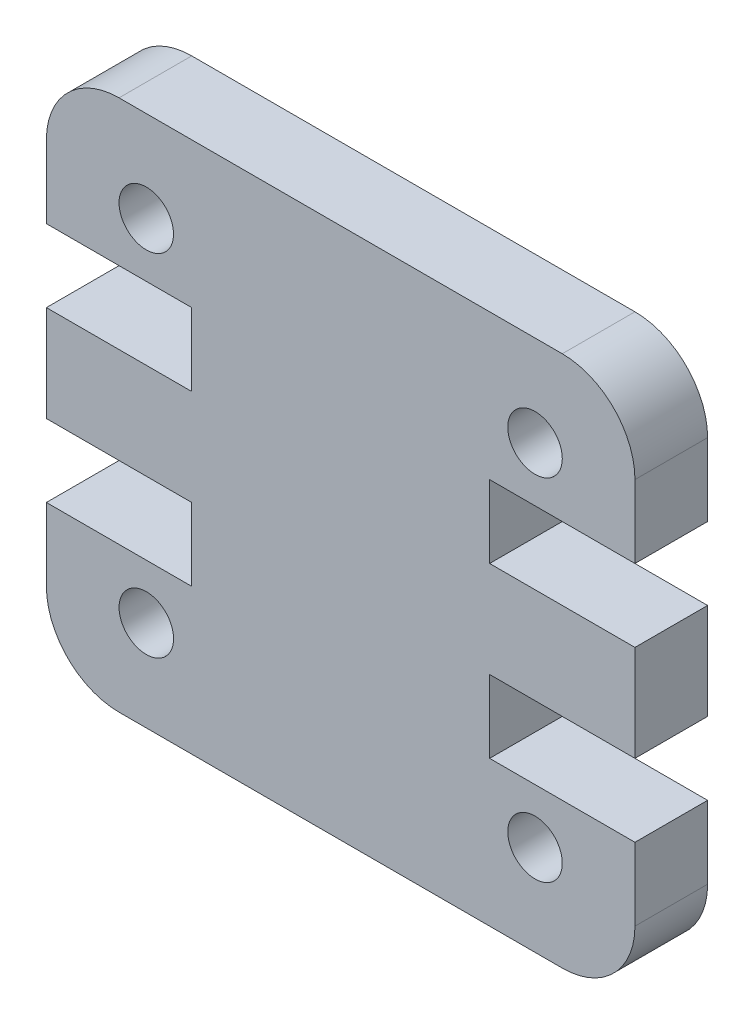
ISO-10303-21;
HEADER;
FILE_DESCRIPTION(('STEP AP214'),'2;1');
FILE_NAME('part.step','',(''),(''),'','','');
FILE_SCHEMA(('AUTOMOTIVE_DESIGN { 1 0 10303 214 1 1 1 1 }'));
ENDSEC;
DATA;
#1=APPLICATION_CONTEXT('core data for automotive mechanical design processes');
#2=APPLICATION_PROTOCOL_DEFINITION('international standard','automotive_design',2000,#1);
#3=PRODUCT_CONTEXT('',#1,'mechanical');
#4=PRODUCT('Part','Part','',(#3));
#5=PRODUCT_RELATED_PRODUCT_CATEGORY('part','',(#4));
#6=PRODUCT_DEFINITION_FORMATION('','',#4);
#7=PRODUCT_DEFINITION_CONTEXT('part definition',#1,'design');
#8=PRODUCT_DEFINITION('design','',#6,#7);
#9=PRODUCT_DEFINITION_SHAPE('','',#8);
#10=(LENGTH_UNIT() NAMED_UNIT(*) SI_UNIT(.MILLI.,.METRE.));
#11=(NAMED_UNIT(*) PLANE_ANGLE_UNIT() SI_UNIT($,.RADIAN.));
#12=(NAMED_UNIT(*) SI_UNIT($,.STERADIAN.) SOLID_ANGLE_UNIT());
#13=UNCERTAINTY_MEASURE_WITH_UNIT(LENGTH_MEASURE(1.E-05),#10,'distance_accuracy_value','');
#14=(GEOMETRIC_REPRESENTATION_CONTEXT(3) GLOBAL_UNCERTAINTY_ASSIGNED_CONTEXT((#13)) GLOBAL_UNIT_ASSIGNED_CONTEXT((#10,
#11,#12)) REPRESENTATION_CONTEXT('',''));
#15=CARTESIAN_POINT('',(0.,0.,0.));
#16=DIRECTION('',(0.,0.,1.));
#17=DIRECTION('',(1.,0.,0.));
#18=AXIS2_PLACEMENT_3D('',#15,#16,#17);
#19=CARTESIAN_POINT('',(14.2,2.,2.));
#20=DIRECTION('',(0.,0.,-1.));
#21=DIRECTION('',(-1.,0.,0.));
#22=AXIS2_PLACEMENT_3D('',#19,#20,#21);
#23=PLANE('',#22);
#24=CARTESIAN_POINT('',(13.4499999999986,12.1450000000001,2.));
#25=DIRECTION('',(0.,0.,1.));
#26=DIRECTION('',(1.,0.,0.));
#27=AXIS2_PLACEMENT_3D('',#24,#25,#26);
#28=CIRCLE('',#27,0.750000000000002);
#29=CARTESIAN_POINT('',(14.1999999999986,12.1450000000001,2.));
#30=VERTEX_POINT('',#29);
#31=EDGE_CURVE('E448',#30,#30,#28,.T.);
#32=ORIENTED_EDGE('',*,*,#31,.F.);
#33=EDGE_LOOP('',(#32));
#34=FACE_BOUND('',#33,.T.);
#35=CARTESIAN_POINT('',(13.4499999999986,2.4999999999999,2.));
#36=DIRECTION('',(0.,0.,1.));
#37=DIRECTION('',(-1.,0.,0.));
#38=AXIS2_PLACEMENT_3D('',#35,#36,#37);
#39=CIRCLE('',#38,0.750000000000002);
#40=CARTESIAN_POINT('',(12.6999999999986,2.4999999999999,2.));
#41=VERTEX_POINT('',#40);
#42=EDGE_CURVE('E230',#41,#41,#39,.T.);
#43=ORIENTED_EDGE('',*,*,#42,.F.);
#44=EDGE_LOOP('',(#43));
#45=FACE_BOUND('',#44,.T.);
#46=CARTESIAN_POINT('',(14.2,2.,2.));
#47=DIRECTION('',(0.,0.,1.));
#48=DIRECTION('',(-1.,0.,0.));
#49=AXIS2_PLACEMENT_3D('',#46,#47,#48);
#50=CIRCLE('',#49,2.);
#51=CARTESIAN_POINT('',(14.2,0.,2.));
#52=VERTEX_POINT('',#51);
#53=CARTESIAN_POINT('',(16.2,2.,2.));
#54=VERTEX_POINT('',#53);
#55=EDGE_CURVE('E273',#52,#54,#50,.T.);
#56=ORIENTED_EDGE('',*,*,#55,.T.);
#57=DIRECTION('',(0.,1.,0.));
#58=VECTOR('',#57,1.);
#59=CARTESIAN_POINT('',(16.2,4.,2.));
#60=LINE('',#59,#58);
#61=CARTESIAN_POINT('',(16.2,4.,2.));
#62=VERTEX_POINT('',#61);
#63=EDGE_CURVE('E141',#54,#62,#60,.T.);
#64=ORIENTED_EDGE('',*,*,#63,.T.);
#65=DIRECTION('',(-1.,0.,0.));
#66=VECTOR('',#65,1.);
#67=CARTESIAN_POINT('',(12.2,4.,2.));
#68=LINE('',#67,#66);
#69=CARTESIAN_POINT('',(12.2,4.,2.));
#70=VERTEX_POINT('',#69);
#71=EDGE_CURVE('E336',#62,#70,#68,.T.);
#72=ORIENTED_EDGE('',*,*,#71,.T.);
#73=DIRECTION('',(0.,1.,0.));
#74=VECTOR('',#73,1.);
#75=CARTESIAN_POINT('',(12.2,6.,2.));
#76=LINE('',#75,#74);
#77=CARTESIAN_POINT('',(12.2,6.,2.));
#78=VERTEX_POINT('',#77);
#79=EDGE_CURVE('E355',#70,#78,#76,.T.);
#80=ORIENTED_EDGE('',*,*,#79,.T.);
#81=DIRECTION('',(1.,0.,0.));
#82=VECTOR('',#81,1.);
#83=CARTESIAN_POINT('',(16.2,6.,2.));
#84=LINE('',#83,#82);
#85=CARTESIAN_POINT('',(16.2,6.,2.));
#86=VERTEX_POINT('',#85);
#87=EDGE_CURVE('E352',#78,#86,#84,.T.);
#88=ORIENTED_EDGE('',*,*,#87,.T.);
#89=DIRECTION('',(0.,1.,0.));
#90=VECTOR('',#89,1.);
#91=CARTESIAN_POINT('',(16.2,8.64499999999999,2.));
#92=LINE('',#91,#90);
#93=CARTESIAN_POINT('',(16.2,8.64499999999999,2.));
#94=VERTEX_POINT('',#93);
#95=EDGE_CURVE('E354',#86,#94,#92,.T.);
#96=ORIENTED_EDGE('',*,*,#95,.T.);
#97=DIRECTION('',(-1.,0.,0.));
#98=VECTOR('',#97,1.);
#99=CARTESIAN_POINT('',(16.2,8.64499999999999,2.));
#100=LINE('',#99,#98);
#101=CARTESIAN_POINT('',(12.2,8.64499999999999,2.));
#102=VERTEX_POINT('',#101);
#103=EDGE_CURVE('E357',#94,#102,#100,.T.);
#104=ORIENTED_EDGE('',*,*,#103,.T.);
#105=DIRECTION('',(0.,1.,0.));
#106=VECTOR('',#105,1.);
#107=CARTESIAN_POINT('',(12.2,8.64499999999999,2.));
#108=LINE('',#107,#106);
#109=CARTESIAN_POINT('',(12.2,10.645,2.));
#110=VERTEX_POINT('',#109);
#111=EDGE_CURVE('E363',#102,#110,#108,.T.);
#112=ORIENTED_EDGE('',*,*,#111,.T.);
#113=DIRECTION('',(1.,0.,0.));
#114=VECTOR('',#113,1.);
#115=CARTESIAN_POINT('',(12.2,10.645,2.));
#116=LINE('',#115,#114);
#117=CARTESIAN_POINT('',(16.2,10.645,2.));
#118=VERTEX_POINT('',#117);
#119=EDGE_CURVE('E365',#110,#118,#116,.T.);
#120=ORIENTED_EDGE('',*,*,#119,.T.);
#121=DIRECTION('',(0.,1.,0.));
#122=VECTOR('',#121,1.);
#123=CARTESIAN_POINT('',(16.2,10.645,2.));
#124=LINE('',#123,#122);
#125=CARTESIAN_POINT('',(16.2,12.645,2.));
#126=VERTEX_POINT('',#125);
#127=EDGE_CURVE('E367',#118,#126,#124,.T.);
#128=ORIENTED_EDGE('',*,*,#127,.T.);
#129=CARTESIAN_POINT('',(14.2,12.645,2.));
#130=DIRECTION('',(0.,0.,1.));
#131=DIRECTION('',(1.,0.,0.));
#132=AXIS2_PLACEMENT_3D('',#129,#130,#131);
#133=CIRCLE('',#132,2.);
#134=CARTESIAN_POINT('',(14.2,14.645,2.));
#135=VERTEX_POINT('',#134);
#136=EDGE_CURVE('E369',#126,#135,#133,.T.);
#137=ORIENTED_EDGE('',*,*,#136,.T.);
#138=DIRECTION('',(-1.,0.,0.));
#139=VECTOR('',#138,1.);
#140=CARTESIAN_POINT('',(2.,14.645,2.));
#141=LINE('',#140,#139);
#142=CARTESIAN_POINT('',(2.,14.645,2.));
#143=VERTEX_POINT('',#142);
#144=EDGE_CURVE('E371',#135,#143,#141,.T.);
#145=ORIENTED_EDGE('',*,*,#144,.T.);
#146=CARTESIAN_POINT('',(2.,12.645,2.));
#147=DIRECTION('',(0.,0.,1.));
#148=DIRECTION('',(-1.,0.,0.));
#149=AXIS2_PLACEMENT_3D('',#146,#147,#148);
#150=CIRCLE('',#149,2.);
#151=CARTESIAN_POINT('',(0.,12.645,2.));
#152=VERTEX_POINT('',#151);
#153=EDGE_CURVE('E373',#143,#152,#150,.T.);
#154=ORIENTED_EDGE('',*,*,#153,.T.);
#155=DIRECTION('',(0.,-1.,0.));
#156=VECTOR('',#155,1.);
#157=CARTESIAN_POINT('',(0.,10.645,2.));
#158=LINE('',#157,#156);
#159=CARTESIAN_POINT('',(0.,10.645,2.));
#160=VERTEX_POINT('',#159);
#161=EDGE_CURVE('E375',#152,#160,#158,.T.);
#162=ORIENTED_EDGE('',*,*,#161,.T.);
#163=DIRECTION('',(1.,0.,0.));
#164=VECTOR('',#163,1.);
#165=CARTESIAN_POINT('',(4.,10.645,2.));
#166=LINE('',#165,#164);
#167=CARTESIAN_POINT('',(4.,10.645,2.));
#168=VERTEX_POINT('',#167);
#169=EDGE_CURVE('E377',#160,#168,#166,.T.);
#170=ORIENTED_EDGE('',*,*,#169,.T.);
#171=DIRECTION('',(0.,-1.,0.));
#172=VECTOR('',#171,1.);
#173=CARTESIAN_POINT('',(4.,8.64499999999999,2.));
#174=LINE('',#173,#172);
#175=CARTESIAN_POINT('',(4.,8.64499999999999,2.));
#176=VERTEX_POINT('',#175);
#177=EDGE_CURVE('E379',#168,#176,#174,.T.);
#178=ORIENTED_EDGE('',*,*,#177,.T.);
#179=DIRECTION('',(-1.,0.,0.));
#180=VECTOR('',#179,1.);
#181=CARTESIAN_POINT('',(0.,8.64499999999999,2.));
#182=LINE('',#181,#180);
#183=CARTESIAN_POINT('',(0.,8.64499999999999,2.));
#184=VERTEX_POINT('',#183);
#185=EDGE_CURVE('E381',#176,#184,#182,.T.);
#186=ORIENTED_EDGE('',*,*,#185,.T.);
#187=DIRECTION('',(0.,-1.,0.));
#188=VECTOR('',#187,1.);
#189=CARTESIAN_POINT('',(0.,8.64499999999999,2.));
#190=LINE('',#189,#188);
#191=CARTESIAN_POINT('',(0.,6.00000000000003,2.));
#192=VERTEX_POINT('',#191);
#193=EDGE_CURVE('E383',#184,#192,#190,.T.);
#194=ORIENTED_EDGE('',*,*,#193,.T.);
#195=DIRECTION('',(1.,0.,0.));
#196=VECTOR('',#195,1.);
#197=CARTESIAN_POINT('',(0.,6.00000000000003,2.));
#198=LINE('',#197,#196);
#199=CARTESIAN_POINT('',(4.00000000000003,6.00000000000003,2.));
#200=VERTEX_POINT('',#199);
#201=EDGE_CURVE('E385',#192,#200,#198,.T.);
#202=ORIENTED_EDGE('',*,*,#201,.T.);
#203=DIRECTION('',(0.,-1.,0.));
#204=VECTOR('',#203,1.);
#205=CARTESIAN_POINT('',(4.00000000000003,6.00000000000003,2.));
#206=LINE('',#205,#204);
#207=CARTESIAN_POINT('',(4.00000000000003,4.00000000000002,2.));
#208=VERTEX_POINT('',#207);
#209=EDGE_CURVE('E387',#200,#208,#206,.T.);
#210=ORIENTED_EDGE('',*,*,#209,.T.);
#211=DIRECTION('',(-1.,0.,0.));
#212=VECTOR('',#211,1.);
#213=CARTESIAN_POINT('',(4.00000000000003,4.00000000000002,2.));
#214=LINE('',#213,#212);
#215=CARTESIAN_POINT('',(0.,4.00000000000003,2.));
#216=VERTEX_POINT('',#215);
#217=EDGE_CURVE('E208',#208,#216,#214,.T.);
#218=ORIENTED_EDGE('',*,*,#217,.T.);
#219=DIRECTION('',(0.,-1.,0.));
#220=VECTOR('',#219,1.);
#221=CARTESIAN_POINT('',(0.,4.00000000000003,2.));
#222=LINE('',#221,#220);
#223=CARTESIAN_POINT('',(0.,2.00000000000003,2.));
#224=VERTEX_POINT('',#223);
#225=EDGE_CURVE('E202',#216,#224,#222,.T.);
#226=ORIENTED_EDGE('',*,*,#225,.T.);
#227=CARTESIAN_POINT('',(2.,2.,2.));
#228=DIRECTION('',(0.,0.,1.));
#229=DIRECTION('',(1.,0.,0.));
#230=AXIS2_PLACEMENT_3D('',#227,#228,#229);
#231=CIRCLE('',#230,2.);
#232=CARTESIAN_POINT('',(2.,0.,2.));
#233=VERTEX_POINT('',#232);
#234=EDGE_CURVE('E206',#224,#233,#231,.T.);
#235=ORIENTED_EDGE('',*,*,#234,.T.);
#236=DIRECTION('',(1.,0.,0.));
#237=VECTOR('',#236,1.);
#238=CARTESIAN_POINT('',(2.,0.,2.));
#239=LINE('',#238,#237);
#240=EDGE_CURVE('E50',#233,#52,#239,.T.);
#241=ORIENTED_EDGE('',*,*,#240,.T.);
#242=EDGE_LOOP('',(#56,#64,#72,#80,#88,#96,#104,#112,#120,#128,#137,#145,#154,#162,#170,#178,
#186,#194,#202,#210,#218,#226,#235,#241));
#243=FACE_BOUND('',#242,.T.);
#244=CARTESIAN_POINT('',(2.75000000000139,12.1450000000001,2.));
#245=DIRECTION('',(0.,0.,1.));
#246=DIRECTION('',(-1.,0.,0.));
#247=AXIS2_PLACEMENT_3D('',#244,#245,#246);
#248=CIRCLE('',#247,0.750000000000001);
#249=CARTESIAN_POINT('',(2.00000000000139,12.1450000000001,2.));
#250=VERTEX_POINT('',#249);
#251=EDGE_CURVE('E454',#250,#250,#248,.T.);
#252=ORIENTED_EDGE('',*,*,#251,.F.);
#253=EDGE_LOOP('',(#252));
#254=FACE_BOUND('',#253,.T.);
#255=CARTESIAN_POINT('',(2.75000000000139,2.4999999999999,2.));
#256=DIRECTION('',(0.,0.,1.));
#257=DIRECTION('',(1.,0.,0.));
#258=AXIS2_PLACEMENT_3D('',#255,#256,#257);
#259=CIRCLE('',#258,0.75);
#260=CARTESIAN_POINT('',(3.50000000000139,2.4999999999999,2.));
#261=VERTEX_POINT('',#260);
#262=EDGE_CURVE('E439',#261,#261,#259,.T.);
#263=ORIENTED_EDGE('',*,*,#262,.F.);
#264=EDGE_LOOP('',(#263));
#265=FACE_BOUND('',#264,.T.);
#266=ADVANCED_FACE('F33',(#34,#45,#243,#254,#265),#23,.F.);
#267=CARTESIAN_POINT('',(14.2,2.,0.));
#268=DIRECTION('',(0.,0.,-1.));
#269=DIRECTION('',(-1.,0.,0.));
#270=AXIS2_PLACEMENT_3D('',#267,#268,#269);
#271=PLANE('',#270);
#272=CARTESIAN_POINT('',(13.4499999999986,12.1450000000001,0.));
#273=DIRECTION('',(0.,0.,1.));
#274=DIRECTION('',(1.,0.,0.));
#275=AXIS2_PLACEMENT_3D('',#272,#273,#274);
#276=CIRCLE('',#275,0.750000000000002);
#277=CARTESIAN_POINT('',(14.1999999999986,12.1450000000001,0.));
#278=VERTEX_POINT('',#277);
#279=EDGE_CURVE('E445',#278,#278,#276,.T.);
#280=ORIENTED_EDGE('',*,*,#279,.T.);
#281=EDGE_LOOP('',(#280));
#282=FACE_BOUND('',#281,.T.);
#283=CARTESIAN_POINT('',(13.4499999999986,2.4999999999999,0.));
#284=DIRECTION('',(0.,0.,1.));
#285=DIRECTION('',(-1.,0.,0.));
#286=AXIS2_PLACEMENT_3D('',#283,#284,#285);
#287=CIRCLE('',#286,0.750000000000002);
#288=CARTESIAN_POINT('',(12.6999999999986,2.4999999999999,0.));
#289=VERTEX_POINT('',#288);
#290=EDGE_CURVE('E457',#289,#289,#287,.T.);
#291=ORIENTED_EDGE('',*,*,#290,.T.);
#292=EDGE_LOOP('',(#291));
#293=FACE_BOUND('',#292,.T.);
#294=CARTESIAN_POINT('',(14.2,2.,0.));
#295=DIRECTION('',(0.,0.,1.));
#296=DIRECTION('',(-1.,0.,0.));
#297=AXIS2_PLACEMENT_3D('',#294,#295,#296);
#298=CIRCLE('',#297,2.);
#299=CARTESIAN_POINT('',(14.2,0.,0.));
#300=VERTEX_POINT('',#299);
#301=CARTESIAN_POINT('',(16.2,2.,0.));
#302=VERTEX_POINT('',#301);
#303=EDGE_CURVE('E226',#300,#302,#298,.T.);
#304=ORIENTED_EDGE('',*,*,#303,.F.);
#305=DIRECTION('',(1.,0.,0.));
#306=VECTOR('',#305,1.);
#307=CARTESIAN_POINT('',(2.,0.,0.));
#308=LINE('',#307,#306);
#309=CARTESIAN_POINT('',(2.,0.,0.));
#310=VERTEX_POINT('',#309);
#311=EDGE_CURVE('E133',#310,#300,#308,.T.);
#312=ORIENTED_EDGE('',*,*,#311,.F.);
#313=CARTESIAN_POINT('',(2.,2.,0.));
#314=DIRECTION('',(0.,0.,1.));
#315=DIRECTION('',(1.,0.,0.));
#316=AXIS2_PLACEMENT_3D('',#313,#314,#315);
#317=CIRCLE('',#316,2.);
#318=CARTESIAN_POINT('',(0.,2.00000000000003,0.));
#319=VERTEX_POINT('',#318);
#320=EDGE_CURVE('E127',#319,#310,#317,.T.);
#321=ORIENTED_EDGE('',*,*,#320,.F.);
#322=DIRECTION('',(0.,-1.,0.));
#323=VECTOR('',#322,1.);
#324=CARTESIAN_POINT('',(0.,4.00000000000003,0.));
#325=LINE('',#324,#323);
#326=CARTESIAN_POINT('',(0.,4.00000000000003,0.));
#327=VERTEX_POINT('',#326);
#328=EDGE_CURVE('E216',#327,#319,#325,.T.);
#329=ORIENTED_EDGE('',*,*,#328,.F.);
#330=DIRECTION('',(-1.,0.,0.));
#331=VECTOR('',#330,1.);
#332=CARTESIAN_POINT('',(4.00000000000003,4.00000000000002,0.));
#333=LINE('',#332,#331);
#334=CARTESIAN_POINT('',(4.00000000000003,4.00000000000002,0.));
#335=VERTEX_POINT('',#334);
#336=EDGE_CURVE('E268',#335,#327,#333,.T.);
#337=ORIENTED_EDGE('',*,*,#336,.F.);
#338=DIRECTION('',(0.,-1.,0.));
#339=VECTOR('',#338,1.);
#340=CARTESIAN_POINT('',(4.00000000000003,6.00000000000003,0.));
#341=LINE('',#340,#339);
#342=CARTESIAN_POINT('',(4.00000000000003,6.00000000000003,0.));
#343=VERTEX_POINT('',#342);
#344=EDGE_CURVE('E266',#343,#335,#341,.T.);
#345=ORIENTED_EDGE('',*,*,#344,.F.);
#346=DIRECTION('',(1.,0.,0.));
#347=VECTOR('',#346,1.);
#348=CARTESIAN_POINT('',(0.,6.00000000000003,0.));
#349=LINE('',#348,#347);
#350=CARTESIAN_POINT('',(0.,6.00000000000003,0.));
#351=VERTEX_POINT('',#350);
#352=EDGE_CURVE('E264',#351,#343,#349,.T.);
#353=ORIENTED_EDGE('',*,*,#352,.F.);
#354=DIRECTION('',(0.,-1.,0.));
#355=VECTOR('',#354,1.);
#356=CARTESIAN_POINT('',(0.,8.64499999999999,0.));
#357=LINE('',#356,#355);
#358=CARTESIAN_POINT('',(0.,8.64499999999999,0.));
#359=VERTEX_POINT('',#358);
#360=EDGE_CURVE('E262',#359,#351,#357,.T.);
#361=ORIENTED_EDGE('',*,*,#360,.F.);
#362=DIRECTION('',(-1.,0.,0.));
#363=VECTOR('',#362,1.);
#364=CARTESIAN_POINT('',(0.,8.64499999999999,0.));
#365=LINE('',#364,#363);
#366=CARTESIAN_POINT('',(4.,8.64499999999999,0.));
#367=VERTEX_POINT('',#366);
#368=EDGE_CURVE('E260',#367,#359,#365,.T.);
#369=ORIENTED_EDGE('',*,*,#368,.F.);
#370=DIRECTION('',(0.,-1.,0.));
#371=VECTOR('',#370,1.);
#372=CARTESIAN_POINT('',(4.,8.64499999999999,0.));
#373=LINE('',#372,#371);
#374=CARTESIAN_POINT('',(4.,10.645,0.));
#375=VERTEX_POINT('',#374);
#376=EDGE_CURVE('E258',#375,#367,#373,.T.);
#377=ORIENTED_EDGE('',*,*,#376,.F.);
#378=DIRECTION('',(1.,0.,0.));
#379=VECTOR('',#378,1.);
#380=CARTESIAN_POINT('',(4.,10.645,0.));
#381=LINE('',#380,#379);
#382=CARTESIAN_POINT('',(0.,10.645,0.));
#383=VERTEX_POINT('',#382);
#384=EDGE_CURVE('E256',#383,#375,#381,.T.);
#385=ORIENTED_EDGE('',*,*,#384,.F.);
#386=DIRECTION('',(0.,-1.,0.));
#387=VECTOR('',#386,1.);
#388=CARTESIAN_POINT('',(0.,10.645,0.));
#389=LINE('',#388,#387);
#390=CARTESIAN_POINT('',(0.,12.645,0.));
#391=VERTEX_POINT('',#390);
#392=EDGE_CURVE('E254',#391,#383,#389,.T.);
#393=ORIENTED_EDGE('',*,*,#392,.F.);
#394=CARTESIAN_POINT('',(2.,12.645,0.));
#395=DIRECTION('',(0.,0.,1.));
#396=DIRECTION('',(-1.,0.,0.));
#397=AXIS2_PLACEMENT_3D('',#394,#395,#396);
#398=CIRCLE('',#397,2.);
#399=CARTESIAN_POINT('',(2.,14.645,0.));
#400=VERTEX_POINT('',#399);
#401=EDGE_CURVE('E252',#400,#391,#398,.T.);
#402=ORIENTED_EDGE('',*,*,#401,.F.);
#403=DIRECTION('',(-1.,0.,0.));
#404=VECTOR('',#403,1.);
#405=CARTESIAN_POINT('',(2.,14.645,0.));
#406=LINE('',#405,#404);
#407=CARTESIAN_POINT('',(14.2,14.645,0.));
#408=VERTEX_POINT('',#407);
#409=EDGE_CURVE('E250',#408,#400,#406,.T.);
#410=ORIENTED_EDGE('',*,*,#409,.F.);
#411=CARTESIAN_POINT('',(14.2,12.645,0.));
#412=DIRECTION('',(0.,0.,1.));
#413=DIRECTION('',(1.,0.,0.));
#414=AXIS2_PLACEMENT_3D('',#411,#412,#413);
#415=CIRCLE('',#414,2.);
#416=CARTESIAN_POINT('',(16.2,12.645,0.));
#417=VERTEX_POINT('',#416);
#418=EDGE_CURVE('E248',#417,#408,#415,.T.);
#419=ORIENTED_EDGE('',*,*,#418,.F.);
#420=DIRECTION('',(0.,1.,0.));
#421=VECTOR('',#420,1.);
#422=CARTESIAN_POINT('',(16.2,10.645,0.));
#423=LINE('',#422,#421);
#424=CARTESIAN_POINT('',(16.2,10.645,0.));
#425=VERTEX_POINT('',#424);
#426=EDGE_CURVE('E246',#425,#417,#423,.T.);
#427=ORIENTED_EDGE('',*,*,#426,.F.);
#428=DIRECTION('',(1.,0.,0.));
#429=VECTOR('',#428,1.);
#430=CARTESIAN_POINT('',(12.2,10.645,0.));
#431=LINE('',#430,#429);
#432=CARTESIAN_POINT('',(12.2,10.645,0.));
#433=VERTEX_POINT('',#432);
#434=EDGE_CURVE('E244',#433,#425,#431,.T.);
#435=ORIENTED_EDGE('',*,*,#434,.F.);
#436=DIRECTION('',(0.,1.,0.));
#437=VECTOR('',#436,1.);
#438=CARTESIAN_POINT('',(12.2,8.64499999999999,0.));
#439=LINE('',#438,#437);
#440=CARTESIAN_POINT('',(12.2,8.64499999999999,0.));
#441=VERTEX_POINT('',#440);
#442=EDGE_CURVE('E242',#441,#433,#439,.T.);
#443=ORIENTED_EDGE('',*,*,#442,.F.);
#444=DIRECTION('',(-1.,0.,0.));
#445=VECTOR('',#444,1.);
#446=CARTESIAN_POINT('',(16.2,8.64499999999999,0.));
#447=LINE('',#446,#445);
#448=CARTESIAN_POINT('',(16.2,8.64499999999999,0.));
#449=VERTEX_POINT('',#448);
#450=EDGE_CURVE('E240',#449,#441,#447,.T.);
#451=ORIENTED_EDGE('',*,*,#450,.F.);
#452=DIRECTION('',(0.,1.,0.));
#453=VECTOR('',#452,1.);
#454=CARTESIAN_POINT('',(16.2,8.64499999999999,0.));
#455=LINE('',#454,#453);
#456=CARTESIAN_POINT('',(16.2,6.,0.));
#457=VERTEX_POINT('',#456);
#458=EDGE_CURVE('E238',#457,#449,#455,.T.);
#459=ORIENTED_EDGE('',*,*,#458,.F.);
#460=DIRECTION('',(1.,0.,0.));
#461=VECTOR('',#460,1.);
#462=CARTESIAN_POINT('',(16.2,6.,0.));
#463=LINE('',#462,#461);
#464=CARTESIAN_POINT('',(12.2,6.,0.));
#465=VERTEX_POINT('',#464);
#466=EDGE_CURVE('E236',#465,#457,#463,.T.);
#467=ORIENTED_EDGE('',*,*,#466,.F.);
#468=DIRECTION('',(0.,1.,0.));
#469=VECTOR('',#468,1.);
#470=CARTESIAN_POINT('',(12.2,6.,0.));
#471=LINE('',#470,#469);
#472=CARTESIAN_POINT('',(12.2,4.,0.));
#473=VERTEX_POINT('',#472);
#474=EDGE_CURVE('E234',#473,#465,#471,.T.);
#475=ORIENTED_EDGE('',*,*,#474,.F.);
#476=DIRECTION('',(-1.,0.,0.));
#477=VECTOR('',#476,1.);
#478=CARTESIAN_POINT('',(12.2,4.,0.));
#479=LINE('',#478,#477);
#480=CARTESIAN_POINT('',(16.2,4.,0.));
#481=VERTEX_POINT('',#480);
#482=EDGE_CURVE('E232',#481,#473,#479,.T.);
#483=ORIENTED_EDGE('',*,*,#482,.F.);
#484=DIRECTION('',(0.,1.,0.));
#485=VECTOR('',#484,1.);
#486=CARTESIAN_POINT('',(16.2,4.,0.));
#487=LINE('',#486,#485);
#488=EDGE_CURVE('E229',#302,#481,#487,.T.);
#489=ORIENTED_EDGE('',*,*,#488,.F.);
#490=EDGE_LOOP('',(#304,#312,#321,#329,#337,#345,#353,#361,#369,#377,#385,#393,#402,#410,#419,
#427,#435,#443,#451,#459,#467,#475,#483,#489));
#491=FACE_BOUND('',#490,.T.);
#492=CARTESIAN_POINT('',(2.75000000000139,12.1450000000001,0.));
#493=DIRECTION('',(0.,0.,1.));
#494=DIRECTION('',(-1.,0.,0.));
#495=AXIS2_PLACEMENT_3D('',#492,#493,#494);
#496=CIRCLE('',#495,0.750000000000001);
#497=CARTESIAN_POINT('',(2.00000000000139,12.1450000000001,0.));
#498=VERTEX_POINT('',#497);
#499=EDGE_CURVE('E451',#498,#498,#496,.T.);
#500=ORIENTED_EDGE('',*,*,#499,.T.);
#501=EDGE_LOOP('',(#500));
#502=FACE_BOUND('',#501,.T.);
#503=CARTESIAN_POINT('',(2.75000000000139,2.4999999999999,0.));
#504=DIRECTION('',(0.,0.,1.));
#505=DIRECTION('',(1.,0.,0.));
#506=AXIS2_PLACEMENT_3D('',#503,#504,#505);
#507=CIRCLE('',#506,0.75);
#508=CARTESIAN_POINT('',(3.50000000000139,2.4999999999999,0.));
#509=VERTEX_POINT('',#508);
#510=EDGE_CURVE('E442',#509,#509,#507,.T.);
#511=ORIENTED_EDGE('',*,*,#510,.T.);
#512=EDGE_LOOP('',(#511));
#513=FACE_BOUND('',#512,.T.);
#514=ADVANCED_FACE('F340',(#282,#293,#491,#502,#513),#271,.T.);
#515=CARTESIAN_POINT('',(14.2,2.,2.));
#516=DIRECTION('',(0.,0.,-1.));
#517=DIRECTION('',(-1.,0.,0.));
#518=AXIS2_PLACEMENT_3D('',#515,#516,#517);
#519=CYLINDRICAL_SURFACE('',#518,2.);
#520=ORIENTED_EDGE('',*,*,#303,.T.);
#521=DIRECTION('',(0.,0.,-1.));
#522=VECTOR('',#521,1.);
#523=CARTESIAN_POINT('',(16.2,2.,2.));
#524=LINE('',#523,#522);
#525=EDGE_CURVE('E11',#54,#302,#524,.T.);
#526=ORIENTED_EDGE('',*,*,#525,.F.);
#527=ORIENTED_EDGE('',*,*,#55,.F.);
#528=DIRECTION('',(0.,0.,-1.));
#529=VECTOR('',#528,1.);
#530=CARTESIAN_POINT('',(14.2,0.,2.));
#531=LINE('',#530,#529);
#532=EDGE_CURVE('E222',#52,#300,#531,.T.);
#533=ORIENTED_EDGE('',*,*,#532,.T.);
#534=EDGE_LOOP('',(#520,#526,#527,#533));
#535=FACE_BOUND('',#534,.T.);
#536=ADVANCED_FACE('F35',(#535),#519,.T.);
#537=CARTESIAN_POINT('',(16.2,4.,2.));
#538=DIRECTION('',(-1.,0.,0.));
#539=DIRECTION('',(0.,0.,1.));
#540=AXIS2_PLACEMENT_3D('',#537,#538,#539);
#541=PLANE('',#540);
#542=ORIENTED_EDGE('',*,*,#488,.T.);
#543=DIRECTION('',(0.,0.,-1.));
#544=VECTOR('',#543,1.);
#545=CARTESIAN_POINT('',(16.2,4.,2.));
#546=LINE('',#545,#544);
#547=EDGE_CURVE('E42',#62,#481,#546,.T.);
#548=ORIENTED_EDGE('',*,*,#547,.F.);
#549=ORIENTED_EDGE('',*,*,#63,.F.);
#550=ORIENTED_EDGE('',*,*,#525,.T.);
#551=EDGE_LOOP('',(#542,#548,#549,#550));
#552=FACE_BOUND('',#551,.T.);
#553=ADVANCED_FACE('F686',(#552),#541,.F.);
#554=CARTESIAN_POINT('',(12.2,4.,2.));
#555=DIRECTION('',(0.,-1.,0.));
#556=DIRECTION('',(1.,0.,0.));
#557=AXIS2_PLACEMENT_3D('',#554,#555,#556);
#558=PLANE('',#557);
#559=ORIENTED_EDGE('',*,*,#482,.T.);
#560=DIRECTION('',(0.,0.,-1.));
#561=VECTOR('',#560,1.);
#562=CARTESIAN_POINT('',(12.2,4.,2.));
#563=LINE('',#562,#561);
#564=EDGE_CURVE('E328',#70,#473,#563,.T.);
#565=ORIENTED_EDGE('',*,*,#564,.F.);
#566=ORIENTED_EDGE('',*,*,#71,.F.);
#567=ORIENTED_EDGE('',*,*,#547,.T.);
#568=EDGE_LOOP('',(#559,#565,#566,#567));
#569=FACE_BOUND('',#568,.T.);
#570=ADVANCED_FACE('F334',(#569),#558,.F.);
#571=CARTESIAN_POINT('',(12.2,6.,2.));
#572=DIRECTION('',(-1.,0.,0.));
#573=DIRECTION('',(0.,0.,1.));
#574=AXIS2_PLACEMENT_3D('',#571,#572,#573);
#575=PLANE('',#574);
#576=ORIENTED_EDGE('',*,*,#474,.T.);
#577=DIRECTION('',(0.,0.,-1.));
#578=VECTOR('',#577,1.);
#579=CARTESIAN_POINT('',(12.2,6.,2.));
#580=LINE('',#579,#578);
#581=EDGE_CURVE('E325',#78,#465,#580,.T.);
#582=ORIENTED_EDGE('',*,*,#581,.F.);
#583=ORIENTED_EDGE('',*,*,#79,.F.);
#584=ORIENTED_EDGE('',*,*,#564,.T.);
#585=EDGE_LOOP('',(#576,#582,#583,#584));
#586=FACE_BOUND('',#585,.T.);
#587=ADVANCED_FACE('F346',(#586),#575,.F.);
#588=CARTESIAN_POINT('',(16.2,6.,2.));
#589=DIRECTION('',(0.,1.,0.));
#590=DIRECTION('',(0.,0.,1.));
#591=AXIS2_PLACEMENT_3D('',#588,#589,#590);
#592=PLANE('',#591);
#593=ORIENTED_EDGE('',*,*,#466,.T.);
#594=DIRECTION('',(0.,0.,-1.));
#595=VECTOR('',#594,1.);
#596=CARTESIAN_POINT('',(16.2,6.,2.));
#597=LINE('',#596,#595);
#598=EDGE_CURVE('E322',#86,#457,#597,.T.);
#599=ORIENTED_EDGE('',*,*,#598,.F.);
#600=ORIENTED_EDGE('',*,*,#87,.F.);
#601=ORIENTED_EDGE('',*,*,#581,.T.);
#602=EDGE_LOOP('',(#593,#599,#600,#601));
#603=FACE_BOUND('',#602,.T.);
#604=ADVANCED_FACE('F350',(#603),#592,.F.);
#605=CARTESIAN_POINT('',(16.2,8.64499999999999,2.));
#606=DIRECTION('',(-1.,0.,0.));
#607=DIRECTION('',(0.,0.,1.));
#608=AXIS2_PLACEMENT_3D('',#605,#606,#607);
#609=PLANE('',#608);
#610=ORIENTED_EDGE('',*,*,#458,.T.);
#611=DIRECTION('',(0.,0.,-1.));
#612=VECTOR('',#611,1.);
#613=CARTESIAN_POINT('',(16.2,8.64499999999999,2.));
#614=LINE('',#613,#612);
#615=EDGE_CURVE('E319',#94,#449,#614,.T.);
#616=ORIENTED_EDGE('',*,*,#615,.F.);
#617=ORIENTED_EDGE('',*,*,#95,.F.);
#618=ORIENTED_EDGE('',*,*,#598,.T.);
#619=EDGE_LOOP('',(#610,#616,#617,#618));
#620=FACE_BOUND('',#619,.T.);
#621=ADVANCED_FACE('F651',(#620),#609,.F.);
#622=CARTESIAN_POINT('',(16.2,8.64499999999999,2.));
#623=DIRECTION('',(0.,-1.,0.));
#624=DIRECTION('',(0.,0.,-1.));
#625=AXIS2_PLACEMENT_3D('',#622,#623,#624);
#626=PLANE('',#625);
#627=ORIENTED_EDGE('',*,*,#450,.T.);
#628=DIRECTION('',(0.,0.,-1.));
#629=VECTOR('',#628,1.);
#630=CARTESIAN_POINT('',(12.2,8.64499999999999,2.));
#631=LINE('',#630,#629);
#632=EDGE_CURVE('E316',#102,#441,#631,.T.);
#633=ORIENTED_EDGE('',*,*,#632,.F.);
#634=ORIENTED_EDGE('',*,*,#103,.F.);
#635=ORIENTED_EDGE('',*,*,#615,.T.);
#636=EDGE_LOOP('',(#627,#633,#634,#635));
#637=FACE_BOUND('',#636,.T.);
#638=ADVANCED_FACE('F641',(#637),#626,.F.);
#639=CARTESIAN_POINT('',(12.2,8.64499999999999,2.));
#640=DIRECTION('',(-1.,0.,0.));
#641=DIRECTION('',(0.,0.,1.));
#642=AXIS2_PLACEMENT_3D('',#639,#640,#641);
#643=PLANE('',#642);
#644=ORIENTED_EDGE('',*,*,#442,.T.);
#645=DIRECTION('',(0.,0.,-1.));
#646=VECTOR('',#645,1.);
#647=CARTESIAN_POINT('',(12.2,10.645,2.));
#648=LINE('',#647,#646);
#649=EDGE_CURVE('E313',#110,#433,#648,.T.);
#650=ORIENTED_EDGE('',*,*,#649,.F.);
#651=ORIENTED_EDGE('',*,*,#111,.F.);
#652=ORIENTED_EDGE('',*,*,#632,.T.);
#653=EDGE_LOOP('',(#644,#650,#651,#652));
#654=FACE_BOUND('',#653,.T.);
#655=ADVANCED_FACE('F631',(#654),#643,.F.);
#656=CARTESIAN_POINT('',(12.2,10.645,2.));
#657=DIRECTION('',(0.,1.,0.));
#658=DIRECTION('',(-1.,0.,0.));
#659=AXIS2_PLACEMENT_3D('',#656,#657,#658);
#660=PLANE('',#659);
#661=ORIENTED_EDGE('',*,*,#434,.T.);
#662=DIRECTION('',(0.,0.,-1.));
#663=VECTOR('',#662,1.);
#664=CARTESIAN_POINT('',(16.2,10.645,2.));
#665=LINE('',#664,#663);
#666=EDGE_CURVE('E310',#118,#425,#665,.T.);
#667=ORIENTED_EDGE('',*,*,#666,.F.);
#668=ORIENTED_EDGE('',*,*,#119,.F.);
#669=ORIENTED_EDGE('',*,*,#649,.T.);
#670=EDGE_LOOP('',(#661,#667,#668,#669));
#671=FACE_BOUND('',#670,.T.);
#672=ADVANCED_FACE('F621',(#671),#660,.F.);
#673=CARTESIAN_POINT('',(16.2,10.645,2.));
#674=DIRECTION('',(-1.,0.,0.));
#675=DIRECTION('',(0.,0.,1.));
#676=AXIS2_PLACEMENT_3D('',#673,#674,#675);
#677=PLANE('',#676);
#678=ORIENTED_EDGE('',*,*,#426,.T.);
#679=DIRECTION('',(0.,0.,-1.));
#680=VECTOR('',#679,1.);
#681=CARTESIAN_POINT('',(16.2,12.645,2.));
#682=LINE('',#681,#680);
#683=EDGE_CURVE('E307',#126,#417,#682,.T.);
#684=ORIENTED_EDGE('',*,*,#683,.F.);
#685=ORIENTED_EDGE('',*,*,#127,.F.);
#686=ORIENTED_EDGE('',*,*,#666,.T.);
#687=EDGE_LOOP('',(#678,#684,#685,#686));
#688=FACE_BOUND('',#687,.T.);
#689=ADVANCED_FACE('F611',(#688),#677,.F.);
#690=CARTESIAN_POINT('',(14.2,12.645,2.));
#691=DIRECTION('',(0.,0.,-1.));
#692=DIRECTION('',(-1.,0.,0.));
#693=AXIS2_PLACEMENT_3D('',#690,#691,#692);
#694=CYLINDRICAL_SURFACE('',#693,2.);
#695=ORIENTED_EDGE('',*,*,#418,.T.);
#696=DIRECTION('',(0.,0.,-1.));
#697=VECTOR('',#696,1.);
#698=CARTESIAN_POINT('',(14.2,14.645,2.));
#699=LINE('',#698,#697);
#700=EDGE_CURVE('E304',#135,#408,#699,.T.);
#701=ORIENTED_EDGE('',*,*,#700,.F.);
#702=ORIENTED_EDGE('',*,*,#136,.F.);
#703=ORIENTED_EDGE('',*,*,#683,.T.);
#704=EDGE_LOOP('',(#695,#701,#702,#703));
#705=FACE_BOUND('',#704,.T.);
#706=ADVANCED_FACE('F601',(#705),#694,.T.);
#707=CARTESIAN_POINT('',(2.,14.645,2.));
#708=DIRECTION('',(0.,-1.,0.));
#709=DIRECTION('',(0.,0.,-1.));
#710=AXIS2_PLACEMENT_3D('',#707,#708,#709);
#711=PLANE('',#710);
#712=ORIENTED_EDGE('',*,*,#409,.T.);
#713=DIRECTION('',(0.,0.,-1.));
#714=VECTOR('',#713,1.);
#715=CARTESIAN_POINT('',(2.,14.645,2.));
#716=LINE('',#715,#714);
#717=EDGE_CURVE('E301',#143,#400,#716,.T.);
#718=ORIENTED_EDGE('',*,*,#717,.F.);
#719=ORIENTED_EDGE('',*,*,#144,.F.);
#720=ORIENTED_EDGE('',*,*,#700,.T.);
#721=EDGE_LOOP('',(#712,#718,#719,#720));
#722=FACE_BOUND('',#721,.T.);
#723=ADVANCED_FACE('F591',(#722),#711,.F.);
#724=CARTESIAN_POINT('',(2.,12.645,2.));
#725=DIRECTION('',(0.,0.,-1.));
#726=DIRECTION('',(-1.,0.,0.));
#727=AXIS2_PLACEMENT_3D('',#724,#725,#726);
#728=CYLINDRICAL_SURFACE('',#727,2.);
#729=ORIENTED_EDGE('',*,*,#401,.T.);
#730=DIRECTION('',(0.,0.,-1.));
#731=VECTOR('',#730,1.);
#732=CARTESIAN_POINT('',(0.,12.645,2.));
#733=LINE('',#732,#731);
#734=EDGE_CURVE('E298',#152,#391,#733,.T.);
#735=ORIENTED_EDGE('',*,*,#734,.F.);
#736=ORIENTED_EDGE('',*,*,#153,.F.);
#737=ORIENTED_EDGE('',*,*,#717,.T.);
#738=EDGE_LOOP('',(#729,#735,#736,#737));
#739=FACE_BOUND('',#738,.T.);
#740=ADVANCED_FACE('F581',(#739),#728,.T.);
#741=CARTESIAN_POINT('',(0.,10.645,2.));
#742=DIRECTION('',(1.,0.,0.));
#743=DIRECTION('',(0.,0.,-1.));
#744=AXIS2_PLACEMENT_3D('',#741,#742,#743);
#745=PLANE('',#744);
#746=ORIENTED_EDGE('',*,*,#392,.T.);
#747=DIRECTION('',(0.,0.,-1.));
#748=VECTOR('',#747,1.);
#749=CARTESIAN_POINT('',(0.,10.645,2.));
#750=LINE('',#749,#748);
#751=EDGE_CURVE('E295',#160,#383,#750,.T.);
#752=ORIENTED_EDGE('',*,*,#751,.F.);
#753=ORIENTED_EDGE('',*,*,#161,.F.);
#754=ORIENTED_EDGE('',*,*,#734,.T.);
#755=EDGE_LOOP('',(#746,#752,#753,#754));
#756=FACE_BOUND('',#755,.T.);
#757=ADVANCED_FACE('F571',(#756),#745,.F.);
#758=CARTESIAN_POINT('',(4.,10.645,2.));
#759=DIRECTION('',(0.,1.,0.));
#760=DIRECTION('',(-1.,0.,0.));
#761=AXIS2_PLACEMENT_3D('',#758,#759,#760);
#762=PLANE('',#761);
#763=ORIENTED_EDGE('',*,*,#384,.T.);
#764=DIRECTION('',(0.,0.,-1.));
#765=VECTOR('',#764,1.);
#766=CARTESIAN_POINT('',(4.,10.645,2.));
#767=LINE('',#766,#765);
#768=EDGE_CURVE('E292',#168,#375,#767,.T.);
#769=ORIENTED_EDGE('',*,*,#768,.F.);
#770=ORIENTED_EDGE('',*,*,#169,.F.);
#771=ORIENTED_EDGE('',*,*,#751,.T.);
#772=EDGE_LOOP('',(#763,#769,#770,#771));
#773=FACE_BOUND('',#772,.T.);
#774=ADVANCED_FACE('F561',(#773),#762,.F.);
#775=CARTESIAN_POINT('',(4.,8.64499999999999,2.));
#776=DIRECTION('',(1.,0.,0.));
#777=DIRECTION('',(0.,0.,-1.));
#778=AXIS2_PLACEMENT_3D('',#775,#776,#777);
#779=PLANE('',#778);
#780=ORIENTED_EDGE('',*,*,#376,.T.);
#781=DIRECTION('',(0.,0.,-1.));
#782=VECTOR('',#781,1.);
#783=CARTESIAN_POINT('',(4.,8.64499999999999,2.));
#784=LINE('',#783,#782);
#785=EDGE_CURVE('E289',#176,#367,#784,.T.);
#786=ORIENTED_EDGE('',*,*,#785,.F.);
#787=ORIENTED_EDGE('',*,*,#177,.F.);
#788=ORIENTED_EDGE('',*,*,#768,.T.);
#789=EDGE_LOOP('',(#780,#786,#787,#788));
#790=FACE_BOUND('',#789,.T.);
#791=ADVANCED_FACE('F551',(#790),#779,.F.);
#792=CARTESIAN_POINT('',(0.,8.64499999999999,2.));
#793=DIRECTION('',(0.,-1.,0.));
#794=DIRECTION('',(0.,0.,-1.));
#795=AXIS2_PLACEMENT_3D('',#792,#793,#794);
#796=PLANE('',#795);
#797=ORIENTED_EDGE('',*,*,#368,.T.);
#798=DIRECTION('',(0.,0.,-1.));
#799=VECTOR('',#798,1.);
#800=CARTESIAN_POINT('',(0.,8.64499999999999,2.));
#801=LINE('',#800,#799);
#802=EDGE_CURVE('E286',#184,#359,#801,.T.);
#803=ORIENTED_EDGE('',*,*,#802,.F.);
#804=ORIENTED_EDGE('',*,*,#185,.F.);
#805=ORIENTED_EDGE('',*,*,#785,.T.);
#806=EDGE_LOOP('',(#797,#803,#804,#805));
#807=FACE_BOUND('',#806,.T.);
#808=ADVANCED_FACE('F541',(#807),#796,.F.);
#809=CARTESIAN_POINT('',(0.,8.64499999999999,2.));
#810=DIRECTION('',(1.,0.,0.));
#811=DIRECTION('',(0.,1.,0.));
#812=AXIS2_PLACEMENT_3D('',#809,#810,#811);
#813=PLANE('',#812);
#814=ORIENTED_EDGE('',*,*,#360,.T.);
#815=DIRECTION('',(0.,0.,-1.));
#816=VECTOR('',#815,1.);
#817=CARTESIAN_POINT('',(0.,6.00000000000003,2.));
#818=LINE('',#817,#816);
#819=EDGE_CURVE('E283',#192,#351,#818,.T.);
#820=ORIENTED_EDGE('',*,*,#819,.F.);
#821=ORIENTED_EDGE('',*,*,#193,.F.);
#822=ORIENTED_EDGE('',*,*,#802,.T.);
#823=EDGE_LOOP('',(#814,#820,#821,#822));
#824=FACE_BOUND('',#823,.T.);
#825=ADVANCED_FACE('F531',(#824),#813,.F.);
#826=CARTESIAN_POINT('',(0.,6.00000000000003,2.));
#827=DIRECTION('',(0.,1.,0.));
#828=DIRECTION('',(-1.,0.,0.));
#829=AXIS2_PLACEMENT_3D('',#826,#827,#828);
#830=PLANE('',#829);
#831=ORIENTED_EDGE('',*,*,#352,.T.);
#832=DIRECTION('',(0.,0.,-1.));
#833=VECTOR('',#832,1.);
#834=CARTESIAN_POINT('',(4.00000000000003,6.00000000000003,2.));
#835=LINE('',#834,#833);
#836=EDGE_CURVE('E280',#200,#343,#835,.T.);
#837=ORIENTED_EDGE('',*,*,#836,.F.);
#838=ORIENTED_EDGE('',*,*,#201,.F.);
#839=ORIENTED_EDGE('',*,*,#819,.T.);
#840=EDGE_LOOP('',(#831,#837,#838,#839));
#841=FACE_BOUND('',#840,.T.);
#842=ADVANCED_FACE('F522',(#841),#830,.F.);
#843=CARTESIAN_POINT('',(4.00000000000003,6.00000000000003,2.));
#844=DIRECTION('',(1.,0.,0.));
#845=DIRECTION('',(0.,0.,-1.));
#846=AXIS2_PLACEMENT_3D('',#843,#844,#845);
#847=PLANE('',#846);
#848=ORIENTED_EDGE('',*,*,#344,.T.);
#849=DIRECTION('',(0.,0.,-1.));
#850=VECTOR('',#849,1.);
#851=CARTESIAN_POINT('',(4.00000000000003,4.00000000000002,2.));
#852=LINE('',#851,#850);
#853=EDGE_CURVE('E277',#208,#335,#852,.T.);
#854=ORIENTED_EDGE('',*,*,#853,.F.);
#855=ORIENTED_EDGE('',*,*,#209,.F.);
#856=ORIENTED_EDGE('',*,*,#836,.T.);
#857=EDGE_LOOP('',(#848,#854,#855,#856));
#858=FACE_BOUND('',#857,.T.);
#859=ADVANCED_FACE('F393',(#858),#847,.F.);
#860=CARTESIAN_POINT('',(4.00000000000003,4.00000000000002,2.));
#861=DIRECTION('',(0.,-1.,0.));
#862=DIRECTION('',(1.,0.,0.));
#863=AXIS2_PLACEMENT_3D('',#860,#861,#862);
#864=PLANE('',#863);
#865=ORIENTED_EDGE('',*,*,#336,.T.);
#866=DIRECTION('',(0.,0.,-1.));
#867=VECTOR('',#866,1.);
#868=CARTESIAN_POINT('',(0.,4.00000000000003,2.));
#869=LINE('',#868,#867);
#870=EDGE_CURVE('E217',#216,#327,#869,.T.);
#871=ORIENTED_EDGE('',*,*,#870,.F.);
#872=ORIENTED_EDGE('',*,*,#217,.F.);
#873=ORIENTED_EDGE('',*,*,#853,.T.);
#874=EDGE_LOOP('',(#865,#871,#872,#873));
#875=FACE_BOUND('',#874,.T.);
#876=ADVANCED_FACE('F397',(#875),#864,.F.);
#877=CARTESIAN_POINT('',(0.,4.00000000000003,2.));
#878=DIRECTION('',(1.,0.,0.));
#879=DIRECTION('',(0.,1.,0.));
#880=AXIS2_PLACEMENT_3D('',#877,#878,#879);
#881=PLANE('',#880);
#882=ORIENTED_EDGE('',*,*,#328,.T.);
#883=DIRECTION('',(0.,0.,-1.));
#884=VECTOR('',#883,1.);
#885=CARTESIAN_POINT('',(0.,2.00000000000003,2.));
#886=LINE('',#885,#884);
#887=EDGE_CURVE('E213',#224,#319,#886,.T.);
#888=ORIENTED_EDGE('',*,*,#887,.F.);
#889=ORIENTED_EDGE('',*,*,#225,.F.);
#890=ORIENTED_EDGE('',*,*,#870,.T.);
#891=EDGE_LOOP('',(#882,#888,#889,#890));
#892=FACE_BOUND('',#891,.T.);
#893=ADVANCED_FACE('F214',(#892),#881,.F.);
#894=CARTESIAN_POINT('',(2.,2.,2.));
#895=DIRECTION('',(0.,0.,-1.));
#896=DIRECTION('',(-1.,0.,0.));
#897=AXIS2_PLACEMENT_3D('',#894,#895,#896);
#898=CYLINDRICAL_SURFACE('',#897,2.);
#899=ORIENTED_EDGE('',*,*,#320,.T.);
#900=DIRECTION('',(0.,0.,-1.));
#901=VECTOR('',#900,1.);
#902=CARTESIAN_POINT('',(2.,0.,2.));
#903=LINE('',#902,#901);
#904=EDGE_CURVE('E218',#233,#310,#903,.T.);
#905=ORIENTED_EDGE('',*,*,#904,.F.);
#906=ORIENTED_EDGE('',*,*,#234,.F.);
#907=ORIENTED_EDGE('',*,*,#887,.T.);
#908=EDGE_LOOP('',(#899,#905,#906,#907));
#909=FACE_BOUND('',#908,.T.);
#910=ADVANCED_FACE('F220',(#909),#898,.T.);
#911=CARTESIAN_POINT('',(2.,0.,2.));
#912=DIRECTION('',(0.,1.,0.));
#913=DIRECTION('',(0.,0.,1.));
#914=AXIS2_PLACEMENT_3D('',#911,#912,#913);
#915=PLANE('',#914);
#916=ORIENTED_EDGE('',*,*,#311,.T.);
#917=ORIENTED_EDGE('',*,*,#532,.F.);
#918=ORIENTED_EDGE('',*,*,#240,.F.);
#919=ORIENTED_EDGE('',*,*,#904,.T.);
#920=EDGE_LOOP('',(#916,#917,#918,#919));
#921=FACE_BOUND('',#920,.T.);
#922=ADVANCED_FACE('F401',(#921),#915,.F.);
#923=CARTESIAN_POINT('',(13.4499999999986,2.4999999999999,2.));
#924=DIRECTION('',(0.,0.,-1.));
#925=DIRECTION('',(-1.,0.,0.));
#926=AXIS2_PLACEMENT_3D('',#923,#924,#925);
#927=CYLINDRICAL_SURFACE('',#926,0.750000000000002);
#928=ORIENTED_EDGE('',*,*,#42,.T.);
#929=EDGE_LOOP('',(#928));
#930=FACE_BOUND('',#929,.T.);
#931=ORIENTED_EDGE('',*,*,#290,.F.);
#932=EDGE_LOOP('',(#931));
#933=FACE_BOUND('',#932,.T.);
#934=ADVANCED_FACE('F403',(#930,#933),#927,.F.);
#935=CARTESIAN_POINT('',(2.75000000000139,12.1450000000001,2.));
#936=DIRECTION('',(0.,0.,-1.));
#937=DIRECTION('',(-1.,0.,0.));
#938=AXIS2_PLACEMENT_3D('',#935,#936,#937);
#939=CYLINDRICAL_SURFACE('',#938,0.750000000000001);
#940=ORIENTED_EDGE('',*,*,#251,.T.);
#941=EDGE_LOOP('',(#940));
#942=FACE_BOUND('',#941,.T.);
#943=ORIENTED_EDGE('',*,*,#499,.F.);
#944=EDGE_LOOP('',(#943));
#945=FACE_BOUND('',#944,.T.);
#946=ADVANCED_FACE('F409',(#942,#945),#939,.F.);
#947=CARTESIAN_POINT('',(13.4499999999986,12.1450000000001,2.));
#948=DIRECTION('',(0.,0.,-1.));
#949=DIRECTION('',(-1.,0.,0.));
#950=AXIS2_PLACEMENT_3D('',#947,#948,#949);
#951=CYLINDRICAL_SURFACE('',#950,0.750000000000002);
#952=ORIENTED_EDGE('',*,*,#31,.T.);
#953=EDGE_LOOP('',(#952));
#954=FACE_BOUND('',#953,.T.);
#955=ORIENTED_EDGE('',*,*,#279,.F.);
#956=EDGE_LOOP('',(#955));
#957=FACE_BOUND('',#956,.T.);
#958=ADVANCED_FACE('F426',(#954,#957),#951,.F.);
#959=CARTESIAN_POINT('',(2.75000000000139,2.4999999999999,2.));
#960=DIRECTION('',(0.,0.,-1.));
#961=DIRECTION('',(-1.,0.,0.));
#962=AXIS2_PLACEMENT_3D('',#959,#960,#961);
#963=CYLINDRICAL_SURFACE('',#962,0.75);
#964=ORIENTED_EDGE('',*,*,#262,.T.);
#965=EDGE_LOOP('',(#964));
#966=FACE_BOUND('',#965,.T.);
#967=ORIENTED_EDGE('',*,*,#510,.F.);
#968=EDGE_LOOP('',(#967));
#969=FACE_BOUND('',#968,.T.);
#970=ADVANCED_FACE('F430',(#966,#969),#963,.F.);
#971=CLOSED_SHELL('',(#266,#514,#536,#553,#570,#587,#604,#621,#638,#655,#672,#689,#706,#723,
#740,#757,#774,#791,#808,#825,#842,#859,#876,#893,#910,#922,#934,#946,#958,#970));
#972=MANIFOLD_SOLID_BREP('B2',#971);
#973=ADVANCED_BREP_SHAPE_REPRESENTATION('',(#18,#972),#14);
#974=SHAPE_DEFINITION_REPRESENTATION(#9,#973);
ENDSEC;
END-ISO-10303-21;
